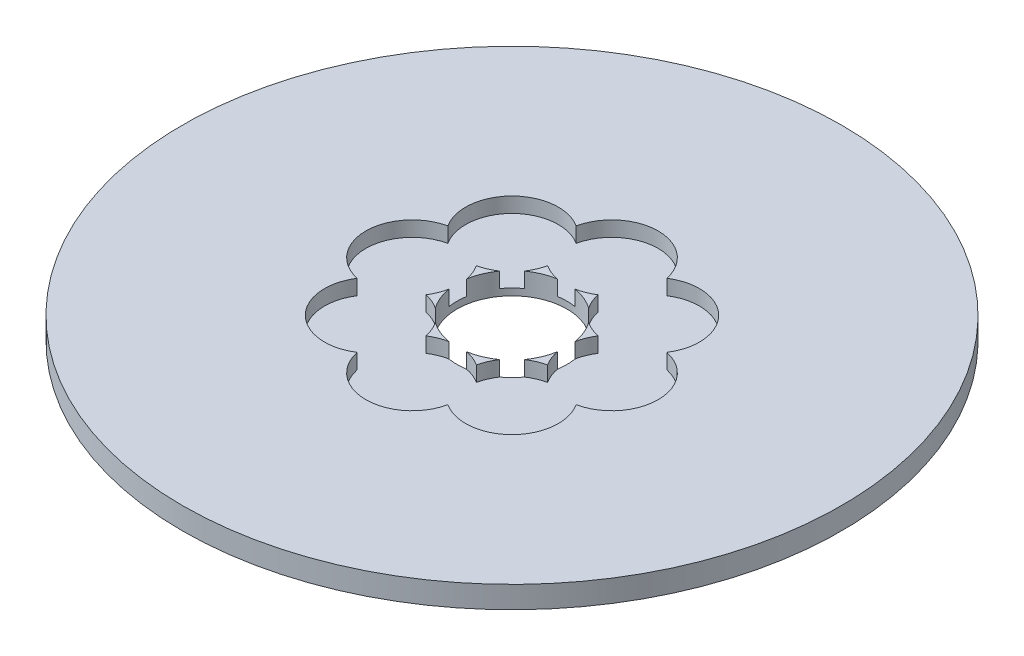
ISO-10303-21;
HEADER;
FILE_DESCRIPTION(('STEP AP214'),'2;1');
FILE_NAME('part.step','',(''),(''),'','','');
FILE_SCHEMA(('AUTOMOTIVE_DESIGN { 1 0 10303 214 1 1 1 1 }'));
ENDSEC;
DATA;
#1=APPLICATION_CONTEXT('core data for automotive mechanical design processes');
#2=APPLICATION_PROTOCOL_DEFINITION('international standard','automotive_design',2000,#1);
#3=PRODUCT_CONTEXT('',#1,'mechanical');
#4=PRODUCT('Part','Part','',(#3));
#5=PRODUCT_RELATED_PRODUCT_CATEGORY('part','',(#4));
#6=PRODUCT_DEFINITION_FORMATION('','',#4);
#7=PRODUCT_DEFINITION_CONTEXT('part definition',#1,'design');
#8=PRODUCT_DEFINITION('design','',#6,#7);
#9=PRODUCT_DEFINITION_SHAPE('','',#8);
#10=(LENGTH_UNIT() NAMED_UNIT(*) SI_UNIT(.MILLI.,.METRE.));
#11=(NAMED_UNIT(*) PLANE_ANGLE_UNIT() SI_UNIT($,.RADIAN.));
#12=(NAMED_UNIT(*) SI_UNIT($,.STERADIAN.) SOLID_ANGLE_UNIT());
#13=UNCERTAINTY_MEASURE_WITH_UNIT(LENGTH_MEASURE(1.E-05),#10,'distance_accuracy_value','');
#14=(GEOMETRIC_REPRESENTATION_CONTEXT(3) GLOBAL_UNCERTAINTY_ASSIGNED_CONTEXT((#13)) GLOBAL_UNIT_ASSIGNED_CONTEXT((#10,
#11,#12)) REPRESENTATION_CONTEXT('',''));
#15=CARTESIAN_POINT('',(0.,0.,0.));
#16=DIRECTION('',(0.,0.,1.));
#17=DIRECTION('',(1.,0.,0.));
#18=AXIS2_PLACEMENT_3D('',#15,#16,#17);
#19=CARTESIAN_POINT('',(0.,4.,0.));
#20=DIRECTION('',(0.,1.,0.));
#21=DIRECTION('',(0.,0.,1.));
#22=AXIS2_PLACEMENT_3D('',#19,#20,#21);
#23=PLANE('',#22);
#24=CARTESIAN_POINT('',(-12.8441599159706,4.,12.8441599159706));
#25=DIRECTION('',(0.,1.,0.));
#26=DIRECTION('',(0.707106781186549,0.,0.707106781186546));
#27=AXIS2_PLACEMENT_3D('',#24,#25,#26);
#28=CIRCLE('',#27,8.44678448829901);
#29=CARTESIAN_POINT('',(-8.11242340434932,4.,5.84710069252834));
#30=VERTEX_POINT('',#29);
#31=CARTESIAN_POINT('',(-11.0707231779052,4.,4.5856436855665));
#32=VERTEX_POINT('',#31);
#33=EDGE_CURVE('E380',#30,#32,#28,.T.);
#34=ORIENTED_EDGE('',*,*,#33,.F.);
#35=CARTESIAN_POINT('',(0.,4.,0.));
#36=DIRECTION('',(0.,1.,0.));
#37=DIRECTION('',(0.,0.,1.));
#38=AXIS2_PLACEMENT_3D('',#35,#36,#37);
#39=CIRCLE('',#38,10.);
#40=CARTESIAN_POINT('',(-9.8708741510392,4.,1.60182505110453));
#41=VERTEX_POINT('',#40);
#42=EDGE_CURVE('E407',#41,#30,#39,.T.);
#43=ORIENTED_EDGE('',*,*,#42,.F.);
#44=CARTESIAN_POINT('',(-18.1643851504545,4.,0.));
#45=DIRECTION('',(0.,1.,0.));
#46=DIRECTION('',(0.,0.,1.));
#47=AXIS2_PLACEMENT_3D('',#44,#45,#46);
#48=CIRCLE('',#47,8.44678448829901);
#49=EDGE_CURVE('E410',#32,#41,#48,.T.);
#50=ORIENTED_EDGE('',*,*,#49,.F.);
#51=EDGE_LOOP('',(#34,#43,#50));
#52=FACE_BOUND('',#51,.T.);
#53=ADVANCED_FACE('F39',(#52),#23,.T.);
#54=CARTESIAN_POINT('',(-12.8441599159708,4.,-12.8441599159705));
#55=DIRECTION('',(0.,1.,0.));
#56=DIRECTION('',(-0.707106781186539,0.,0.707106781186556));
#57=AXIS2_PLACEMENT_3D('',#54,#55,#56);
#58=CIRCLE('',#57,8.44678448829901);
#59=CARTESIAN_POINT('',(-11.0707231779051,4.,-4.58564368556637));
#60=VERTEX_POINT('',#59);
#61=CARTESIAN_POINT('',(-8.11242340434941,4.,-5.84710069252823));
#62=VERTEX_POINT('',#61);
#63=EDGE_CURVE('E285',#60,#62,#58,.T.);
#64=ORIENTED_EDGE('',*,*,#63,.F.);
#65=CARTESIAN_POINT('',(-9.8708741510392,4.,-1.60182505110453));
#66=VERTEX_POINT('',#65);
#67=EDGE_CURVE('E401',#66,#60,#48,.T.);
#68=ORIENTED_EDGE('',*,*,#67,.F.);
#69=EDGE_CURVE('E412',#62,#66,#39,.T.);
#70=ORIENTED_EDGE('',*,*,#69,.F.);
#71=EDGE_LOOP('',(#64,#68,#70));
#72=FACE_BOUND('',#71,.T.);
#73=ADVANCED_FACE('F533',(#72),#23,.T.);
#74=CARTESIAN_POINT('',(-1.90261835353114E-13,4.,-18.1643851504545));
#75=DIRECTION('',(0.,1.,0.));
#76=DIRECTION('',(-1.,0.,0.));
#77=AXIS2_PLACEMENT_3D('',#74,#75,#76);
#78=CIRCLE('',#77,8.44678448829901);
#79=CARTESIAN_POINT('',(1.60182505110443,4.,-9.87087415103922));
#80=VERTEX_POINT('',#79);
#81=CARTESIAN_POINT('',(4.58564368556638,4.,-11.0707231779052));
#82=VERTEX_POINT('',#81);
#83=EDGE_CURVE('E301',#80,#82,#78,.T.);
#84=ORIENTED_EDGE('',*,*,#83,.F.);
#85=CARTESIAN_POINT('',(5.84710069252825,4.,-8.11242340434938));
#86=VERTEX_POINT('',#85);
#87=EDGE_CURVE('E511',#86,#80,#39,.T.);
#88=ORIENTED_EDGE('',*,*,#87,.F.);
#89=CARTESIAN_POINT('',(12.8441599159705,4.,-12.8441599159707));
#90=DIRECTION('',(0.,1.,0.));
#91=DIRECTION('',(-0.707106781186554,0.,-0.707106781186541));
#92=AXIS2_PLACEMENT_3D('',#89,#90,#91);
#93=CIRCLE('',#92,8.44678448829901);
#94=EDGE_CURVE('E313',#82,#86,#93,.T.);
#95=ORIENTED_EDGE('',*,*,#94,.F.);
#96=EDGE_LOOP('',(#84,#88,#95));
#97=FACE_BOUND('',#96,.T.);
#98=ADVANCED_FACE('F574',(#97),#23,.T.);
#99=CARTESIAN_POINT('',(8.11242340434928,4.,-5.84710069252839));
#100=VERTEX_POINT('',#99);
#101=CARTESIAN_POINT('',(11.0707231779052,4.,-4.58564368556656));
#102=VERTEX_POINT('',#101);
#103=EDGE_CURVE('E315',#100,#102,#93,.T.);
#104=ORIENTED_EDGE('',*,*,#103,.F.);
#105=CARTESIAN_POINT('',(9.87087415103921,4.,-1.60182505110454));
#106=VERTEX_POINT('',#105);
#107=EDGE_CURVE('E512',#106,#100,#39,.T.);
#108=ORIENTED_EDGE('',*,*,#107,.F.);
#109=CARTESIAN_POINT('',(18.1643851504545,4.,0.));
#110=DIRECTION('',(0.,1.,0.));
#111=DIRECTION('',(0.,0.,-1.));
#112=AXIS2_PLACEMENT_3D('',#109,#110,#111);
#113=CIRCLE('',#112,8.44678448829901);
#114=EDGE_CURVE('E324',#102,#106,#113,.T.);
#115=ORIENTED_EDGE('',*,*,#114,.F.);
#116=EDGE_LOOP('',(#104,#108,#115));
#117=FACE_BOUND('',#116,.T.);
#118=ADVANCED_FACE('F597',(#117),#23,.T.);
#119=CARTESIAN_POINT('',(9.87087415103921,4.,1.60182505110454));
#120=VERTEX_POINT('',#119);
#121=CARTESIAN_POINT('',(11.0707231779051,4.,4.58564368556644));
#122=VERTEX_POINT('',#121);
#123=EDGE_CURVE('E330',#120,#122,#113,.T.);
#124=ORIENTED_EDGE('',*,*,#123,.F.);
#125=CARTESIAN_POINT('',(8.11242340434937,4.,5.84710069252828));
#126=VERTEX_POINT('',#125);
#127=EDGE_CURVE('E502',#126,#120,#39,.T.);
#128=ORIENTED_EDGE('',*,*,#127,.F.);
#129=CARTESIAN_POINT('',(12.8441599159707,4.,12.8441599159705));
#130=DIRECTION('',(0.,1.,0.));
#131=DIRECTION('',(0.707106781186544,0.,-0.707106781186551));
#132=AXIS2_PLACEMENT_3D('',#129,#130,#131);
#133=CIRCLE('',#132,8.44678448829901);
#134=EDGE_CURVE('E336',#122,#126,#133,.T.);
#135=ORIENTED_EDGE('',*,*,#134,.F.);
#136=EDGE_LOOP('',(#124,#128,#135));
#137=FACE_BOUND('',#136,.T.);
#138=ADVANCED_FACE('F505',(#137),#23,.T.);
#139=CARTESIAN_POINT('',(5.84710069252837,4.,8.1124234043493));
#140=VERTEX_POINT('',#139);
#141=CARTESIAN_POINT('',(4.58564368556654,4.,11.0707231779051));
#142=VERTEX_POINT('',#141);
#143=EDGE_CURVE('E325',#140,#142,#133,.T.);
#144=ORIENTED_EDGE('',*,*,#143,.F.);
#145=CARTESIAN_POINT('',(1.60182505110457,4.,9.8708741510392));
#146=VERTEX_POINT('',#145);
#147=EDGE_CURVE('E509',#146,#140,#39,.T.);
#148=ORIENTED_EDGE('',*,*,#147,.F.);
#149=CARTESIAN_POINT('',(0.,4.,18.1643851504545));
#150=DIRECTION('',(0.,1.,0.));
#151=DIRECTION('',(1.,0.,0.));
#152=AXIS2_PLACEMENT_3D('',#149,#150,#151);
#153=CIRCLE('',#152,8.44678448829901);
#154=EDGE_CURVE('E349',#142,#146,#153,.T.);
#155=ORIENTED_EDGE('',*,*,#154,.F.);
#156=EDGE_LOOP('',(#144,#148,#155));
#157=FACE_BOUND('',#156,.T.);
#158=ADVANCED_FACE('F508',(#157),#23,.T.);
#159=CARTESIAN_POINT('',(-1.6018250511045,4.,9.87087415103921));
#160=VERTEX_POINT('',#159);
#161=CARTESIAN_POINT('',(-4.58564368556646,4.,11.0707231779052));
#162=VERTEX_POINT('',#161);
#163=EDGE_CURVE('E351',#160,#162,#153,.T.);
#164=ORIENTED_EDGE('',*,*,#163,.F.);
#165=CARTESIAN_POINT('',(-5.84710069252831,4.,8.11242340434934));
#166=VERTEX_POINT('',#165);
#167=EDGE_CURVE('E415',#166,#160,#39,.T.);
#168=ORIENTED_EDGE('',*,*,#167,.F.);
#169=EDGE_CURVE('E374',#162,#166,#28,.T.);
#170=ORIENTED_EDGE('',*,*,#169,.F.);
#171=EDGE_LOOP('',(#164,#168,#170));
#172=FACE_BOUND('',#171,.T.);
#173=ADVANCED_FACE('F467',(#172),#23,.T.);
#174=CARTESIAN_POINT('',(-4.58564368556661,4.,-11.0707231779051));
#175=VERTEX_POINT('',#174);
#176=CARTESIAN_POINT('',(-1.60182505110464,4.,-9.87087415103919));
#177=VERTEX_POINT('',#176);
#178=EDGE_CURVE('E257',#175,#177,#78,.T.);
#179=ORIENTED_EDGE('',*,*,#178,.F.);
#180=CARTESIAN_POINT('',(-5.84710069252842,4.,-8.11242340434926));
#181=VERTEX_POINT('',#180);
#182=EDGE_CURVE('E282',#181,#175,#58,.T.);
#183=ORIENTED_EDGE('',*,*,#182,.F.);
#184=EDGE_CURVE('E299',#177,#181,#39,.T.);
#185=ORIENTED_EDGE('',*,*,#184,.F.);
#186=EDGE_LOOP('',(#179,#183,#185));
#187=FACE_BOUND('',#186,.T.);
#188=ADVANCED_FACE('F298',(#187),#23,.T.);
#189=CARTESIAN_POINT('',(-18.1643851504545,1.24408715647174,0.));
#190=DIRECTION('',(0.,1.,0.));
#191=DIRECTION('',(0.,0.,1.));
#192=AXIS2_PLACEMENT_3D('',#189,#190,#191);
#193=CYLINDRICAL_SURFACE('',#192,8.44678448829901);
#194=CARTESIAN_POINT('',(-18.1643851504545,1.24408715647174,0.));
#195=DIRECTION('',(0.,1.,0.));
#196=DIRECTION('',(0.,0.,1.));
#197=AXIS2_PLACEMENT_3D('',#194,#195,#196);
#198=CIRCLE('',#197,8.44678448829901);
#199=CARTESIAN_POINT('',(-11.0707231779052,1.24408715647174,4.5856436855665));
#200=VERTEX_POINT('',#199);
#201=CARTESIAN_POINT('',(-9.8708741510392,1.24408715647174,1.60182505110453));
#202=VERTEX_POINT('',#201);
#203=EDGE_CURVE('E65',#200,#202,#198,.T.);
#204=ORIENTED_EDGE('',*,*,#203,.F.);
#205=DIRECTION('',(0.,1.,0.));
#206=VECTOR('',#205,1.);
#207=CARTESIAN_POINT('',(-11.0707231779052,2.62204357823587,4.5856436855665));
#208=LINE('',#207,#206);
#209=EDGE_CURVE('E387',#200,#32,#208,.T.);
#210=ORIENTED_EDGE('',*,*,#209,.T.);
#211=ORIENTED_EDGE('',*,*,#49,.T.);
#212=DIRECTION('',(0.,1.,0.));
#213=VECTOR('',#212,1.);
#214=CARTESIAN_POINT('',(-9.87087415103921,2.62204357823587,1.60182505110454));
#215=LINE('',#214,#213);
#216=EDGE_CURVE('E424',#41,#202,#215,.F.);
#217=ORIENTED_EDGE('',*,*,#216,.T.);
#218=EDGE_LOOP('',(#204,#210,#211,#217));
#219=FACE_BOUND('',#218,.T.);
#220=ADVANCED_FACE('F590',(#219),#193,.F.);
#221=CARTESIAN_POINT('',(-19.9378218885202,4.,-8.25851623040409));
#222=VERTEX_POINT('',#221);
#223=CARTESIAN_POINT('',(-19.9378218885199,4.,8.25851623040414));
#224=VERTEX_POINT('',#223);
#225=EDGE_CURVE('E406',#222,#224,#48,.T.);
#226=ORIENTED_EDGE('',*,*,#225,.T.);
#227=DIRECTION('',(0.,1.,0.));
#228=VECTOR('',#227,1.);
#229=CARTESIAN_POINT('',(-19.9378218885199,2.62204357823587,8.25851623040414));
#230=LINE('',#229,#228);
#231=CARTESIAN_POINT('',(-19.9378218885199,1.24408715647174,8.25851623040414));
#232=VERTEX_POINT('',#231);
#233=EDGE_CURVE('E382',#224,#232,#230,.F.);
#234=ORIENTED_EDGE('',*,*,#233,.T.);
#235=CARTESIAN_POINT('',(-19.9378218885202,1.24408715647174,-8.25851623040409));
#236=VERTEX_POINT('',#235);
#237=EDGE_CURVE('E405',#236,#232,#198,.T.);
#238=ORIENTED_EDGE('',*,*,#237,.F.);
#239=DIRECTION('',(0.,1.,0.));
#240=VECTOR('',#239,1.);
#241=CARTESIAN_POINT('',(-19.9378218885202,2.62204357823587,-8.25851623040409));
#242=LINE('',#241,#240);
#243=EDGE_CURVE('E273',#236,#222,#242,.T.);
#244=ORIENTED_EDGE('',*,*,#243,.T.);
#245=EDGE_LOOP('',(#226,#234,#238,#244));
#246=FACE_BOUND('',#245,.T.);
#247=ADVANCED_FACE('F544',(#246),#193,.F.);
#248=CARTESIAN_POINT('',(0.,4.,0.));
#249=DIRECTION('',(0.,-1.,0.));
#250=DIRECTION('',(0.,0.,-1.));
#251=AXIS2_PLACEMENT_3D('',#248,#249,#250);
#252=CYLINDRICAL_SURFACE('',#251,60.);
#253=CARTESIAN_POINT('',(0.,4.,0.));
#254=DIRECTION('',(0.,1.,0.));
#255=DIRECTION('',(0.,0.,1.));
#256=AXIS2_PLACEMENT_3D('',#253,#254,#255);
#257=CIRCLE('',#256,60.);
#258=CARTESIAN_POINT('',(0.,4.,60.));
#259=VERTEX_POINT('',#258);
#260=EDGE_CURVE('E418',#259,#259,#257,.T.);
#261=ORIENTED_EDGE('',*,*,#260,.F.);
#262=EDGE_LOOP('',(#261));
#263=FACE_BOUND('',#262,.T.);
#264=CARTESIAN_POINT('',(0.,0.,0.));
#265=DIRECTION('',(0.,1.,0.));
#266=DIRECTION('',(0.,0.,1.));
#267=AXIS2_PLACEMENT_3D('',#264,#265,#266);
#268=CIRCLE('',#267,60.);
#269=CARTESIAN_POINT('',(0.,0.,60.));
#270=VERTEX_POINT('',#269);
#271=EDGE_CURVE('E411',#270,#270,#268,.T.);
#272=ORIENTED_EDGE('',*,*,#271,.T.);
#273=EDGE_LOOP('',(#272));
#274=FACE_BOUND('',#273,.T.);
#275=ADVANCED_FACE('F41',(#263,#274),#252,.T.);
#276=CARTESIAN_POINT('',(-8.25851623040407,4.,19.93782188852));
#277=VERTEX_POINT('',#276);
#278=EDGE_CURVE('E366',#224,#277,#28,.T.);
#279=ORIENTED_EDGE('',*,*,#278,.F.);
#280=ORIENTED_EDGE('',*,*,#225,.F.);
#281=CARTESIAN_POINT('',(-8.25851623040435,4.,-19.9378218885199));
#282=VERTEX_POINT('',#281);
#283=EDGE_CURVE('E279',#282,#222,#58,.T.);
#284=ORIENTED_EDGE('',*,*,#283,.F.);
#285=CARTESIAN_POINT('',(8.25851623040393,4.,-19.93782188852));
#286=VERTEX_POINT('',#285);
#287=EDGE_CURVE('E270',#286,#282,#78,.T.);
#288=ORIENTED_EDGE('',*,*,#287,.F.);
#289=CARTESIAN_POINT('',(19.9378218885198,4.,-8.25851623040417));
#290=VERTEX_POINT('',#289);
#291=EDGE_CURVE('E306',#290,#286,#93,.T.);
#292=ORIENTED_EDGE('',*,*,#291,.F.);
#293=CARTESIAN_POINT('',(19.9378218885201,4.,8.25851623040411));
#294=VERTEX_POINT('',#293);
#295=EDGE_CURVE('E318',#294,#290,#113,.T.);
#296=ORIENTED_EDGE('',*,*,#295,.F.);
#297=CARTESIAN_POINT('',(8.25851623040421,4.,19.9378218885199));
#298=VERTEX_POINT('',#297);
#299=EDGE_CURVE('E334',#298,#294,#133,.T.);
#300=ORIENTED_EDGE('',*,*,#299,.F.);
#301=EDGE_CURVE('E345',#277,#298,#153,.T.);
#302=ORIENTED_EDGE('',*,*,#301,.F.);
#303=EDGE_LOOP('',(#279,#280,#284,#288,#292,#296,#300,#302));
#304=FACE_BOUND('',#303,.T.);
#305=ORIENTED_EDGE('',*,*,#260,.T.);
#306=EDGE_LOOP('',(#305));
#307=FACE_BOUND('',#306,.T.);
#308=ADVANCED_FACE('F485',(#304,#307),#23,.T.);
#309=CARTESIAN_POINT('',(0.,0.,0.));
#310=DIRECTION('',(0.,1.,0.));
#311=DIRECTION('',(0.,0.,1.));
#312=AXIS2_PLACEMENT_3D('',#309,#310,#311);
#313=PLANE('',#312);
#314=CARTESIAN_POINT('',(0.,0.,0.));
#315=DIRECTION('',(0.,1.,0.));
#316=DIRECTION('',(0.,0.,1.));
#317=AXIS2_PLACEMENT_3D('',#314,#315,#316);
#318=CIRCLE('',#317,10.);
#319=CARTESIAN_POINT('',(0.,0.,10.));
#320=VERTEX_POINT('',#319);
#321=EDGE_CURVE('E402',#320,#320,#318,.T.);
#322=ORIENTED_EDGE('',*,*,#321,.T.);
#323=EDGE_LOOP('',(#322));
#324=FACE_BOUND('',#323,.T.);
#325=ORIENTED_EDGE('',*,*,#271,.F.);
#326=EDGE_LOOP('',(#325));
#327=FACE_BOUND('',#326,.T.);
#328=ADVANCED_FACE('F577',(#324,#327),#313,.F.);
#329=CARTESIAN_POINT('',(0.,4.,0.));
#330=DIRECTION('',(0.,-1.,0.));
#331=DIRECTION('',(0.,0.,-1.));
#332=AXIS2_PLACEMENT_3D('',#329,#330,#331);
#333=CYLINDRICAL_SURFACE('',#332,10.);
#334=DIRECTION('',(0.,1.,0.));
#335=VECTOR('',#334,1.);
#336=CARTESIAN_POINT('',(-8.11242340434933,2.62204357823587,5.84710069252834));
#337=LINE('',#336,#335);
#338=CARTESIAN_POINT('',(-8.11242340434932,1.24408715647174,5.84710069252834));
#339=VERTEX_POINT('',#338);
#340=EDGE_CURVE('E391',#339,#30,#337,.T.);
#341=ORIENTED_EDGE('',*,*,#340,.F.);
#342=CARTESIAN_POINT('',(0.,1.24408715647174,0.));
#343=DIRECTION('',(0.,1.,0.));
#344=DIRECTION('',(0.,0.,1.));
#345=AXIS2_PLACEMENT_3D('',#342,#343,#344);
#346=CIRCLE('',#345,10.);
#347=CARTESIAN_POINT('',(-5.84710069252831,1.24408715647174,8.11242340434934));
#348=VERTEX_POINT('',#347);
#349=EDGE_CURVE('E396',#339,#348,#346,.T.);
#350=ORIENTED_EDGE('',*,*,#349,.T.);
#351=DIRECTION('',(0.,1.,0.));
#352=VECTOR('',#351,1.);
#353=CARTESIAN_POINT('',(-5.84710069252831,2.62204357823587,8.11242340434934));
#354=LINE('',#353,#352);
#355=EDGE_CURVE('E386',#166,#348,#354,.F.);
#356=ORIENTED_EDGE('',*,*,#355,.F.);
#357=ORIENTED_EDGE('',*,*,#167,.T.);
#358=DIRECTION('',(0.,1.,0.));
#359=VECTOR('',#358,1.);
#360=CARTESIAN_POINT('',(-1.6018250511045,2.62204357823587,9.87087415103921));
#361=LINE('',#360,#359);
#362=CARTESIAN_POINT('',(-1.6018250511045,1.24408715647174,9.87087415103921));
#363=VERTEX_POINT('',#362);
#364=EDGE_CURVE('E11',#363,#160,#361,.T.);
#365=ORIENTED_EDGE('',*,*,#364,.F.);
#366=CARTESIAN_POINT('',(1.60182505110457,1.24408715647174,9.8708741510392));
#367=VERTEX_POINT('',#366);
#368=EDGE_CURVE('E392',#363,#367,#346,.T.);
#369=ORIENTED_EDGE('',*,*,#368,.T.);
#370=DIRECTION('',(0.,1.,0.));
#371=VECTOR('',#370,1.);
#372=CARTESIAN_POINT('',(1.60182505110457,2.62204357823587,9.8708741510392));
#373=LINE('',#372,#371);
#374=EDGE_CURVE('E50',#146,#367,#373,.F.);
#375=ORIENTED_EDGE('',*,*,#374,.F.);
#376=ORIENTED_EDGE('',*,*,#147,.T.);
#377=DIRECTION('',(0.,1.,0.));
#378=VECTOR('',#377,1.);
#379=CARTESIAN_POINT('',(5.84710069252837,2.62204357823587,8.1124234043493));
#380=LINE('',#379,#378);
#381=CARTESIAN_POINT('',(5.84710069252837,1.24408715647174,8.1124234043493));
#382=VERTEX_POINT('',#381);
#383=EDGE_CURVE('E438',#382,#140,#380,.T.);
#384=ORIENTED_EDGE('',*,*,#383,.F.);
#385=CARTESIAN_POINT('',(8.11242340434937,1.24408715647174,5.84710069252828));
#386=VERTEX_POINT('',#385);
#387=EDGE_CURVE('E400',#382,#386,#346,.T.);
#388=ORIENTED_EDGE('',*,*,#387,.T.);
#389=DIRECTION('',(0.,1.,0.));
#390=VECTOR('',#389,1.);
#391=CARTESIAN_POINT('',(8.11242340434937,2.62204357823587,5.84710069252828));
#392=LINE('',#391,#390);
#393=EDGE_CURVE('E440',#126,#386,#392,.F.);
#394=ORIENTED_EDGE('',*,*,#393,.F.);
#395=ORIENTED_EDGE('',*,*,#127,.T.);
#396=DIRECTION('',(0.,1.,0.));
#397=VECTOR('',#396,1.);
#398=CARTESIAN_POINT('',(9.87087415103921,2.62204357823587,1.60182505110454));
#399=LINE('',#398,#397);
#400=CARTESIAN_POINT('',(9.87087415103921,1.24408715647174,1.60182505110454));
#401=VERTEX_POINT('',#400);
#402=EDGE_CURVE('E434',#401,#120,#399,.T.);
#403=ORIENTED_EDGE('',*,*,#402,.F.);
#404=CARTESIAN_POINT('',(9.87087415103921,1.24408715647174,-1.60182505110454));
#405=VERTEX_POINT('',#404);
#406=EDGE_CURVE('E550',#401,#405,#346,.T.);
#407=ORIENTED_EDGE('',*,*,#406,.T.);
#408=DIRECTION('',(0.,1.,0.));
#409=VECTOR('',#408,1.);
#410=CARTESIAN_POINT('',(9.87087415103921,2.62204357823587,-1.60182505110454));
#411=LINE('',#410,#409);
#412=EDGE_CURVE('E433',#106,#405,#411,.F.);
#413=ORIENTED_EDGE('',*,*,#412,.F.);
#414=ORIENTED_EDGE('',*,*,#107,.T.);
#415=DIRECTION('',(0.,1.,0.));
#416=VECTOR('',#415,1.);
#417=CARTESIAN_POINT('',(8.11242340434928,2.62204357823587,-5.84710069252839));
#418=LINE('',#417,#416);
#419=CARTESIAN_POINT('',(8.11242340434928,1.24408715647174,-5.84710069252839));
#420=VERTEX_POINT('',#419);
#421=EDGE_CURVE('E444',#420,#100,#418,.T.);
#422=ORIENTED_EDGE('',*,*,#421,.F.);
#423=CARTESIAN_POINT('',(5.84710069252825,1.24408715647174,-8.11242340434938));
#424=VERTEX_POINT('',#423);
#425=EDGE_CURVE('E548',#420,#424,#346,.T.);
#426=ORIENTED_EDGE('',*,*,#425,.T.);
#427=DIRECTION('',(0.,1.,0.));
#428=VECTOR('',#427,1.);
#429=CARTESIAN_POINT('',(5.84710069252825,2.62204357823587,-8.11242340434938));
#430=LINE('',#429,#428);
#431=EDGE_CURVE('E442',#86,#424,#430,.F.);
#432=ORIENTED_EDGE('',*,*,#431,.F.);
#433=ORIENTED_EDGE('',*,*,#87,.T.);
#434=DIRECTION('',(0.,1.,0.));
#435=VECTOR('',#434,1.);
#436=CARTESIAN_POINT('',(1.60182505110443,2.62204357823587,-9.87087415103922));
#437=LINE('',#436,#435);
#438=CARTESIAN_POINT('',(1.60182505110443,1.24408715647174,-9.87087415103922));
#439=VERTEX_POINT('',#438);
#440=EDGE_CURVE('E431',#439,#80,#437,.T.);
#441=ORIENTED_EDGE('',*,*,#440,.F.);
#442=CARTESIAN_POINT('',(-1.60182505110464,1.24408715647174,-9.87087415103919));
#443=VERTEX_POINT('',#442);
#444=EDGE_CURVE('E552',#439,#443,#346,.T.);
#445=ORIENTED_EDGE('',*,*,#444,.T.);
#446=DIRECTION('',(0.,1.,0.));
#447=VECTOR('',#446,1.);
#448=CARTESIAN_POINT('',(-1.60182505110464,2.62204357823587,-9.87087415103919));
#449=LINE('',#448,#447);
#450=EDGE_CURVE('E427',#177,#443,#449,.F.);
#451=ORIENTED_EDGE('',*,*,#450,.F.);
#452=ORIENTED_EDGE('',*,*,#184,.T.);
#453=DIRECTION('',(0.,1.,0.));
#454=VECTOR('',#453,1.);
#455=CARTESIAN_POINT('',(-5.84710069252842,2.62204357823587,-8.11242340434926));
#456=LINE('',#455,#454);
#457=CARTESIAN_POINT('',(-5.84710069252842,1.24408715647174,-8.11242340434926));
#458=VERTEX_POINT('',#457);
#459=EDGE_CURVE('E289',#458,#181,#456,.T.);
#460=ORIENTED_EDGE('',*,*,#459,.F.);
#461=CARTESIAN_POINT('',(-8.11242340434941,1.24408715647174,-5.84710069252823));
#462=VERTEX_POINT('',#461);
#463=EDGE_CURVE('E554',#458,#462,#346,.T.);
#464=ORIENTED_EDGE('',*,*,#463,.T.);
#465=DIRECTION('',(0.,1.,0.));
#466=VECTOR('',#465,1.);
#467=CARTESIAN_POINT('',(-8.11242340434941,2.62204357823587,-5.84710069252823));
#468=LINE('',#467,#466);
#469=EDGE_CURVE('E379',#62,#462,#468,.F.);
#470=ORIENTED_EDGE('',*,*,#469,.F.);
#471=ORIENTED_EDGE('',*,*,#69,.T.);
#472=DIRECTION('',(0.,1.,0.));
#473=VECTOR('',#472,1.);
#474=CARTESIAN_POINT('',(-9.87087415103921,2.62204357823587,-1.60182505110454));
#475=LINE('',#474,#473);
#476=CARTESIAN_POINT('',(-9.8708741510392,1.24408715647174,-1.60182505110453));
#477=VERTEX_POINT('',#476);
#478=EDGE_CURVE('E426',#477,#66,#475,.T.);
#479=ORIENTED_EDGE('',*,*,#478,.F.);
#480=CARTESIAN_POINT('',(0.,1.24408715647174,0.));
#481=DIRECTION('',(0.,1.,0.));
#482=DIRECTION('',(0.,0.,1.));
#483=AXIS2_PLACEMENT_3D('',#480,#481,#482);
#484=CIRCLE('',#483,10.);
#485=EDGE_CURVE('E420',#477,#202,#484,.T.);
#486=ORIENTED_EDGE('',*,*,#485,.T.);
#487=ORIENTED_EDGE('',*,*,#216,.F.);
#488=ORIENTED_EDGE('',*,*,#42,.T.);
#489=EDGE_LOOP('',(#341,#350,#356,#357,#365,#369,#375,#376,#384,#388,#394,#395,#403,#407,#413,
#414,#422,#426,#432,#433,#441,#445,#451,#452,#460,#464,#470,#471,#479,#486,#487,#488));
#490=FACE_BOUND('',#489,.T.);
#491=ORIENTED_EDGE('',*,*,#321,.F.);
#492=EDGE_LOOP('',(#491));
#493=FACE_BOUND('',#492,.T.);
#494=ADVANCED_FACE('F460',(#490,#493),#333,.F.);
#495=ORIENTED_EDGE('',*,*,#67,.T.);
#496=DIRECTION('',(0.,1.,0.));
#497=VECTOR('',#496,1.);
#498=CARTESIAN_POINT('',(-11.0707231779051,2.62204357823587,-4.58564368556637));
#499=LINE('',#498,#497);
#500=CARTESIAN_POINT('',(-11.0707231779051,1.24408715647174,-4.58564368556637));
#501=VERTEX_POINT('',#500);
#502=EDGE_CURVE('E375',#60,#501,#499,.F.);
#503=ORIENTED_EDGE('',*,*,#502,.T.);
#504=EDGE_CURVE('E397',#477,#501,#198,.T.);
#505=ORIENTED_EDGE('',*,*,#504,.F.);
#506=ORIENTED_EDGE('',*,*,#478,.T.);
#507=EDGE_LOOP('',(#495,#503,#505,#506));
#508=FACE_BOUND('',#507,.T.);
#509=ADVANCED_FACE('F529',(#508),#193,.F.);
#510=CARTESIAN_POINT('',(-18.1643851504545,1.24408715647174,0.));
#511=DIRECTION('',(0.,1.,0.));
#512=DIRECTION('',(0.,0.,1.));
#513=AXIS2_PLACEMENT_3D('',#510,#511,#512);
#514=PLANE('',#513);
#515=CARTESIAN_POINT('',(-12.8441599159708,1.24408715647174,-12.8441599159705));
#516=DIRECTION('',(0.,1.,0.));
#517=DIRECTION('',(-0.707106781186539,0.,0.707106781186556));
#518=AXIS2_PLACEMENT_3D('',#515,#516,#517);
#519=CIRCLE('',#518,8.44678448829901);
#520=CARTESIAN_POINT('',(-8.25851623040435,1.24408715647174,-19.9378218885199));
#521=VERTEX_POINT('',#520);
#522=EDGE_CURVE('E251',#521,#236,#519,.T.);
#523=ORIENTED_EDGE('',*,*,#522,.T.);
#524=ORIENTED_EDGE('',*,*,#237,.T.);
#525=CARTESIAN_POINT('',(-12.8441599159706,1.24408715647174,12.8441599159706));
#526=DIRECTION('',(0.,1.,0.));
#527=DIRECTION('',(0.707106781186549,0.,0.707106781186546));
#528=AXIS2_PLACEMENT_3D('',#525,#526,#527);
#529=CIRCLE('',#528,8.44678448829901);
#530=CARTESIAN_POINT('',(-8.25851623040407,1.24408715647174,19.93782188852));
#531=VERTEX_POINT('',#530);
#532=EDGE_CURVE('E372',#232,#531,#529,.T.);
#533=ORIENTED_EDGE('',*,*,#532,.T.);
#534=CARTESIAN_POINT('',(0.,1.24408715647174,18.1643851504545));
#535=DIRECTION('',(0.,1.,0.));
#536=DIRECTION('',(1.,0.,0.));
#537=AXIS2_PLACEMENT_3D('',#534,#535,#536);
#538=CIRCLE('',#537,8.44678448829901);
#539=CARTESIAN_POINT('',(8.25851623040421,1.24408715647174,19.9378218885199));
#540=VERTEX_POINT('',#539);
#541=EDGE_CURVE('E346',#531,#540,#538,.T.);
#542=ORIENTED_EDGE('',*,*,#541,.T.);
#543=CARTESIAN_POINT('',(12.8441599159707,1.24408715647174,12.8441599159705));
#544=DIRECTION('',(0.,1.,0.));
#545=DIRECTION('',(0.707106781186544,0.,-0.707106781186551));
#546=AXIS2_PLACEMENT_3D('',#543,#544,#545);
#547=CIRCLE('',#546,8.44678448829901);
#548=CARTESIAN_POINT('',(19.9378218885201,1.24408715647174,8.25851623040411));
#549=VERTEX_POINT('',#548);
#550=EDGE_CURVE('E327',#540,#549,#547,.T.);
#551=ORIENTED_EDGE('',*,*,#550,.T.);
#552=CARTESIAN_POINT('',(18.1643851504545,1.24408715647174,0.));
#553=DIRECTION('',(0.,1.,0.));
#554=DIRECTION('',(0.,0.,-1.));
#555=AXIS2_PLACEMENT_3D('',#552,#553,#554);
#556=CIRCLE('',#555,8.44678448829901);
#557=CARTESIAN_POINT('',(19.9378218885198,1.24408715647174,-8.25851623040417));
#558=VERTEX_POINT('',#557);
#559=EDGE_CURVE('E322',#549,#558,#556,.T.);
#560=ORIENTED_EDGE('',*,*,#559,.T.);
#561=CARTESIAN_POINT('',(12.8441599159705,1.24408715647174,-12.8441599159707));
#562=DIRECTION('',(0.,1.,0.));
#563=DIRECTION('',(-0.707106781186554,0.,-0.707106781186541));
#564=AXIS2_PLACEMENT_3D('',#561,#562,#563);
#565=CIRCLE('',#564,8.44678448829901);
#566=CARTESIAN_POINT('',(8.25851623040393,1.24408715647174,-19.93782188852));
#567=VERTEX_POINT('',#566);
#568=EDGE_CURVE('E258',#558,#567,#565,.T.);
#569=ORIENTED_EDGE('',*,*,#568,.T.);
#570=CARTESIAN_POINT('',(-1.90261835353114E-13,1.24408715647174,-18.1643851504545));
#571=DIRECTION('',(0.,1.,0.));
#572=DIRECTION('',(-1.,0.,0.));
#573=AXIS2_PLACEMENT_3D('',#570,#571,#572);
#574=CIRCLE('',#573,8.44678448829901);
#575=EDGE_CURVE('E247',#567,#521,#574,.T.);
#576=ORIENTED_EDGE('',*,*,#575,.T.);
#577=EDGE_LOOP('',(#523,#524,#533,#542,#551,#560,#569,#576));
#578=FACE_BOUND('',#577,.T.);
#579=ORIENTED_EDGE('',*,*,#504,.T.);
#580=EDGE_CURVE('E53',#501,#462,#519,.T.);
#581=ORIENTED_EDGE('',*,*,#580,.T.);
#582=ORIENTED_EDGE('',*,*,#463,.F.);
#583=CARTESIAN_POINT('',(-4.58564368556661,1.24408715647174,-11.0707231779051));
#584=VERTEX_POINT('',#583);
#585=EDGE_CURVE('E277',#458,#584,#519,.T.);
#586=ORIENTED_EDGE('',*,*,#585,.T.);
#587=EDGE_CURVE('E265',#584,#443,#574,.T.);
#588=ORIENTED_EDGE('',*,*,#587,.T.);
#589=ORIENTED_EDGE('',*,*,#444,.F.);
#590=CARTESIAN_POINT('',(4.58564368556638,1.24408715647174,-11.0707231779052));
#591=VERTEX_POINT('',#590);
#592=EDGE_CURVE('E259',#439,#591,#574,.T.);
#593=ORIENTED_EDGE('',*,*,#592,.T.);
#594=EDGE_CURVE('E308',#591,#424,#565,.T.);
#595=ORIENTED_EDGE('',*,*,#594,.T.);
#596=ORIENTED_EDGE('',*,*,#425,.F.);
#597=CARTESIAN_POINT('',(11.0707231779052,1.24408715647174,-4.58564368556656));
#598=VERTEX_POINT('',#597);
#599=EDGE_CURVE('E307',#420,#598,#565,.T.);
#600=ORIENTED_EDGE('',*,*,#599,.T.);
#601=EDGE_CURVE('E317',#598,#405,#556,.T.);
#602=ORIENTED_EDGE('',*,*,#601,.T.);
#603=ORIENTED_EDGE('',*,*,#406,.F.);
#604=CARTESIAN_POINT('',(11.0707231779051,1.24408715647174,4.58564368556644));
#605=VERTEX_POINT('',#604);
#606=EDGE_CURVE('E323',#401,#605,#556,.T.);
#607=ORIENTED_EDGE('',*,*,#606,.T.);
#608=EDGE_CURVE('E332',#605,#386,#547,.T.);
#609=ORIENTED_EDGE('',*,*,#608,.T.);
#610=ORIENTED_EDGE('',*,*,#387,.F.);
#611=CARTESIAN_POINT('',(4.58564368556654,1.24408715647174,11.0707231779051));
#612=VERTEX_POINT('',#611);
#613=EDGE_CURVE('E335',#382,#612,#547,.T.);
#614=ORIENTED_EDGE('',*,*,#613,.T.);
#615=EDGE_CURVE('E342',#612,#367,#538,.T.);
#616=ORIENTED_EDGE('',*,*,#615,.T.);
#617=ORIENTED_EDGE('',*,*,#368,.F.);
#618=CARTESIAN_POINT('',(-4.58564368556646,1.24408715647174,11.0707231779052));
#619=VERTEX_POINT('',#618);
#620=EDGE_CURVE('E350',#363,#619,#538,.T.);
#621=ORIENTED_EDGE('',*,*,#620,.T.);
#622=EDGE_CURVE('E369',#619,#348,#529,.T.);
#623=ORIENTED_EDGE('',*,*,#622,.T.);
#624=ORIENTED_EDGE('',*,*,#349,.F.);
#625=EDGE_CURVE('E373',#339,#200,#529,.T.);
#626=ORIENTED_EDGE('',*,*,#625,.T.);
#627=ORIENTED_EDGE('',*,*,#203,.T.);
#628=ORIENTED_EDGE('',*,*,#485,.F.);
#629=EDGE_LOOP('',(#579,#581,#582,#586,#588,#589,#593,#595,#596,#600,#602,#603,#607,#609,#610,
#614,#616,#617,#621,#623,#624,#626,#627,#628));
#630=FACE_BOUND('',#629,.T.);
#631=ADVANCED_FACE('F249',(#578,#630),#514,.T.);
#632=CARTESIAN_POINT('',(0.,1.24408715647174,18.1643851504545));
#633=DIRECTION('',(0.,1.,0.));
#634=DIRECTION('',(0.,0.,1.));
#635=AXIS2_PLACEMENT_3D('',#632,#633,#634);
#636=CYLINDRICAL_SURFACE('',#635,8.44678448829901);
#637=ORIENTED_EDGE('',*,*,#364,.T.);
#638=ORIENTED_EDGE('',*,*,#163,.T.);
#639=DIRECTION('',(0.,1.,0.));
#640=VECTOR('',#639,1.);
#641=CARTESIAN_POINT('',(-4.58564368556646,2.62204357823587,11.0707231779052));
#642=LINE('',#641,#640);
#643=EDGE_CURVE('E364',#619,#162,#642,.T.);
#644=ORIENTED_EDGE('',*,*,#643,.F.);
#645=ORIENTED_EDGE('',*,*,#620,.F.);
#646=EDGE_LOOP('',(#637,#638,#644,#645));
#647=FACE_BOUND('',#646,.T.);
#648=ADVANCED_FACE('F463',(#647),#636,.F.);
#649=CARTESIAN_POINT('',(12.8441599159705,1.24408715647174,-12.8441599159707));
#650=DIRECTION('',(0.,1.,0.));
#651=DIRECTION('',(0.,0.,1.));
#652=AXIS2_PLACEMENT_3D('',#649,#650,#651);
#653=CYLINDRICAL_SURFACE('',#652,8.44678448829901);
#654=ORIENTED_EDGE('',*,*,#421,.T.);
#655=ORIENTED_EDGE('',*,*,#103,.T.);
#656=DIRECTION('',(0.,1.,0.));
#657=VECTOR('',#656,1.);
#658=CARTESIAN_POINT('',(11.0707231779052,2.62204357823587,-4.58564368556656));
#659=LINE('',#658,#657);
#660=EDGE_CURVE('E312',#598,#102,#659,.T.);
#661=ORIENTED_EDGE('',*,*,#660,.F.);
#662=ORIENTED_EDGE('',*,*,#599,.F.);
#663=EDGE_LOOP('',(#654,#655,#661,#662));
#664=FACE_BOUND('',#663,.T.);
#665=ADVANCED_FACE('F621',(#664),#653,.F.);
#666=CARTESIAN_POINT('',(12.8441599159707,1.24408715647174,12.8441599159705));
#667=DIRECTION('',(0.,1.,0.));
#668=DIRECTION('',(0.,0.,1.));
#669=AXIS2_PLACEMENT_3D('',#666,#667,#668);
#670=CYLINDRICAL_SURFACE('',#669,8.44678448829901);
#671=ORIENTED_EDGE('',*,*,#383,.T.);
#672=ORIENTED_EDGE('',*,*,#143,.T.);
#673=DIRECTION('',(0.,1.,0.));
#674=VECTOR('',#673,1.);
#675=CARTESIAN_POINT('',(4.58564368556654,2.62204357823587,11.0707231779051));
#676=LINE('',#675,#674);
#677=EDGE_CURVE('E338',#612,#142,#676,.T.);
#678=ORIENTED_EDGE('',*,*,#677,.F.);
#679=ORIENTED_EDGE('',*,*,#613,.F.);
#680=EDGE_LOOP('',(#671,#672,#678,#679));
#681=FACE_BOUND('',#680,.T.);
#682=ADVANCED_FACE('F506',(#681),#670,.F.);
#683=CARTESIAN_POINT('',(18.1643851504545,1.24408715647174,0.));
#684=DIRECTION('',(0.,1.,0.));
#685=DIRECTION('',(0.,0.,1.));
#686=AXIS2_PLACEMENT_3D('',#683,#684,#685);
#687=CYLINDRICAL_SURFACE('',#686,8.44678448829901);
#688=ORIENTED_EDGE('',*,*,#402,.T.);
#689=ORIENTED_EDGE('',*,*,#123,.T.);
#690=DIRECTION('',(0.,1.,0.));
#691=VECTOR('',#690,1.);
#692=CARTESIAN_POINT('',(11.0707231779051,2.62204357823587,4.58564368556644));
#693=LINE('',#692,#691);
#694=EDGE_CURVE('E353',#605,#122,#693,.T.);
#695=ORIENTED_EDGE('',*,*,#694,.F.);
#696=ORIENTED_EDGE('',*,*,#606,.F.);
#697=EDGE_LOOP('',(#688,#689,#695,#696));
#698=FACE_BOUND('',#697,.T.);
#699=ADVANCED_FACE('F489',(#698),#687,.F.);
#700=CARTESIAN_POINT('',(-1.90261835353114E-13,1.24408715647174,-18.1643851504545));
#701=DIRECTION('',(0.,1.,0.));
#702=DIRECTION('',(0.,0.,1.));
#703=AXIS2_PLACEMENT_3D('',#700,#701,#702);
#704=CYLINDRICAL_SURFACE('',#703,8.44678448829901);
#705=ORIENTED_EDGE('',*,*,#440,.T.);
#706=ORIENTED_EDGE('',*,*,#83,.T.);
#707=DIRECTION('',(0.,1.,0.));
#708=VECTOR('',#707,1.);
#709=CARTESIAN_POINT('',(4.58564368556638,2.62204357823587,-11.0707231779052));
#710=LINE('',#709,#708);
#711=EDGE_CURVE('E358',#591,#82,#710,.T.);
#712=ORIENTED_EDGE('',*,*,#711,.F.);
#713=ORIENTED_EDGE('',*,*,#592,.F.);
#714=EDGE_LOOP('',(#705,#706,#712,#713));
#715=FACE_BOUND('',#714,.T.);
#716=ADVANCED_FACE('F567',(#715),#704,.F.);
#717=CARTESIAN_POINT('',(-12.8441599159706,1.24408715647174,12.8441599159706));
#718=DIRECTION('',(0.,1.,0.));
#719=DIRECTION('',(0.,0.,1.));
#720=AXIS2_PLACEMENT_3D('',#717,#718,#719);
#721=CYLINDRICAL_SURFACE('',#720,8.44678448829901);
#722=ORIENTED_EDGE('',*,*,#340,.T.);
#723=ORIENTED_EDGE('',*,*,#33,.T.);
#724=ORIENTED_EDGE('',*,*,#209,.F.);
#725=ORIENTED_EDGE('',*,*,#625,.F.);
#726=EDGE_LOOP('',(#722,#723,#724,#725));
#727=FACE_BOUND('',#726,.T.);
#728=ADVANCED_FACE('F560',(#727),#721,.F.);
#729=ORIENTED_EDGE('',*,*,#355,.T.);
#730=ORIENTED_EDGE('',*,*,#622,.F.);
#731=ORIENTED_EDGE('',*,*,#643,.T.);
#732=ORIENTED_EDGE('',*,*,#169,.T.);
#733=EDGE_LOOP('',(#729,#730,#731,#732));
#734=FACE_BOUND('',#733,.T.);
#735=ADVANCED_FACE('F558',(#734),#721,.F.);
#736=ORIENTED_EDGE('',*,*,#278,.T.);
#737=DIRECTION('',(0.,1.,0.));
#738=VECTOR('',#737,1.);
#739=CARTESIAN_POINT('',(-8.25851623040407,2.62204357823587,19.93782188852));
#740=LINE('',#739,#738);
#741=EDGE_CURVE('E362',#277,#531,#740,.F.);
#742=ORIENTED_EDGE('',*,*,#741,.T.);
#743=ORIENTED_EDGE('',*,*,#532,.F.);
#744=ORIENTED_EDGE('',*,*,#233,.F.);
#745=EDGE_LOOP('',(#736,#742,#743,#744));
#746=FACE_BOUND('',#745,.T.);
#747=ADVANCED_FACE('F541',(#746),#721,.F.);
#748=CARTESIAN_POINT('',(-12.8441599159708,1.24408715647174,-12.8441599159705));
#749=DIRECTION('',(0.,1.,0.));
#750=DIRECTION('',(0.,0.,1.));
#751=AXIS2_PLACEMENT_3D('',#748,#749,#750);
#752=CYLINDRICAL_SURFACE('',#751,8.44678448829901);
#753=ORIENTED_EDGE('',*,*,#459,.T.);
#754=ORIENTED_EDGE('',*,*,#182,.T.);
#755=DIRECTION('',(0.,1.,0.));
#756=VECTOR('',#755,1.);
#757=CARTESIAN_POINT('',(-4.58564368556661,2.62204357823587,-11.0707231779051));
#758=LINE('',#757,#756);
#759=EDGE_CURVE('E269',#584,#175,#758,.T.);
#760=ORIENTED_EDGE('',*,*,#759,.F.);
#761=ORIENTED_EDGE('',*,*,#585,.F.);
#762=EDGE_LOOP('',(#753,#754,#760,#761));
#763=FACE_BOUND('',#762,.T.);
#764=ADVANCED_FACE('F290',(#763),#752,.F.);
#765=ORIENTED_EDGE('',*,*,#522,.F.);
#766=DIRECTION('',(0.,1.,0.));
#767=VECTOR('',#766,1.);
#768=CARTESIAN_POINT('',(-8.25851623040435,2.62204357823587,-19.9378218885199));
#769=LINE('',#768,#767);
#770=EDGE_CURVE('E262',#282,#521,#769,.F.);
#771=ORIENTED_EDGE('',*,*,#770,.F.);
#772=ORIENTED_EDGE('',*,*,#283,.T.);
#773=ORIENTED_EDGE('',*,*,#243,.F.);
#774=EDGE_LOOP('',(#765,#771,#772,#773));
#775=FACE_BOUND('',#774,.T.);
#776=ADVANCED_FACE('F275',(#775),#752,.F.);
#777=ORIENTED_EDGE('',*,*,#469,.T.);
#778=ORIENTED_EDGE('',*,*,#580,.F.);
#779=ORIENTED_EDGE('',*,*,#502,.F.);
#780=ORIENTED_EDGE('',*,*,#63,.T.);
#781=EDGE_LOOP('',(#777,#778,#779,#780));
#782=FACE_BOUND('',#781,.T.);
#783=ADVANCED_FACE('F535',(#782),#752,.F.);
#784=ORIENTED_EDGE('',*,*,#374,.T.);
#785=ORIENTED_EDGE('',*,*,#615,.F.);
#786=ORIENTED_EDGE('',*,*,#677,.T.);
#787=ORIENTED_EDGE('',*,*,#154,.T.);
#788=EDGE_LOOP('',(#784,#785,#786,#787));
#789=FACE_BOUND('',#788,.T.);
#790=ADVANCED_FACE('F450',(#789),#636,.F.);
#791=ORIENTED_EDGE('',*,*,#431,.T.);
#792=ORIENTED_EDGE('',*,*,#594,.F.);
#793=ORIENTED_EDGE('',*,*,#711,.T.);
#794=ORIENTED_EDGE('',*,*,#94,.T.);
#795=EDGE_LOOP('',(#791,#792,#793,#794));
#796=FACE_BOUND('',#795,.T.);
#797=ADVANCED_FACE('F619',(#796),#653,.F.);
#798=ORIENTED_EDGE('',*,*,#393,.T.);
#799=ORIENTED_EDGE('',*,*,#608,.F.);
#800=ORIENTED_EDGE('',*,*,#694,.T.);
#801=ORIENTED_EDGE('',*,*,#134,.T.);
#802=EDGE_LOOP('',(#798,#799,#800,#801));
#803=FACE_BOUND('',#802,.T.);
#804=ADVANCED_FACE('F496',(#803),#670,.F.);
#805=ORIENTED_EDGE('',*,*,#301,.T.);
#806=DIRECTION('',(0.,1.,0.));
#807=VECTOR('',#806,1.);
#808=CARTESIAN_POINT('',(8.25851623040421,2.62204357823587,19.9378218885199));
#809=LINE('',#808,#807);
#810=EDGE_CURVE('E329',#298,#540,#809,.F.);
#811=ORIENTED_EDGE('',*,*,#810,.T.);
#812=ORIENTED_EDGE('',*,*,#541,.F.);
#813=ORIENTED_EDGE('',*,*,#741,.F.);
#814=EDGE_LOOP('',(#805,#811,#812,#813));
#815=FACE_BOUND('',#814,.T.);
#816=ADVANCED_FACE('F471',(#815),#636,.F.);
#817=DIRECTION('',(0.,1.,0.));
#818=VECTOR('',#817,1.);
#819=CARTESIAN_POINT('',(19.9378218885201,2.62204357823587,8.25851623040411));
#820=LINE('',#819,#818);
#821=EDGE_CURVE('E347',#294,#549,#820,.F.);
#822=ORIENTED_EDGE('',*,*,#821,.T.);
#823=ORIENTED_EDGE('',*,*,#550,.F.);
#824=ORIENTED_EDGE('',*,*,#810,.F.);
#825=ORIENTED_EDGE('',*,*,#299,.T.);
#826=EDGE_LOOP('',(#822,#823,#824,#825));
#827=FACE_BOUND('',#826,.T.);
#828=ADVANCED_FACE('F477',(#827),#670,.F.);
#829=ORIENTED_EDGE('',*,*,#412,.T.);
#830=ORIENTED_EDGE('',*,*,#601,.F.);
#831=ORIENTED_EDGE('',*,*,#660,.T.);
#832=ORIENTED_EDGE('',*,*,#114,.T.);
#833=EDGE_LOOP('',(#829,#830,#831,#832));
#834=FACE_BOUND('',#833,.T.);
#835=ADVANCED_FACE('F623',(#834),#687,.F.);
#836=ORIENTED_EDGE('',*,*,#295,.T.);
#837=DIRECTION('',(0.,1.,0.));
#838=VECTOR('',#837,1.);
#839=CARTESIAN_POINT('',(19.9378218885198,2.62204357823587,-8.25851623040417));
#840=LINE('',#839,#838);
#841=EDGE_CURVE('E304',#290,#558,#840,.F.);
#842=ORIENTED_EDGE('',*,*,#841,.T.);
#843=ORIENTED_EDGE('',*,*,#559,.F.);
#844=ORIENTED_EDGE('',*,*,#821,.F.);
#845=EDGE_LOOP('',(#836,#842,#843,#844));
#846=FACE_BOUND('',#845,.T.);
#847=ADVANCED_FACE('F630',(#846),#687,.F.);
#848=DIRECTION('',(0.,1.,0.));
#849=VECTOR('',#848,1.);
#850=CARTESIAN_POINT('',(8.25851623040393,2.62204357823587,-19.93782188852));
#851=LINE('',#850,#849);
#852=EDGE_CURVE('E360',#286,#567,#851,.F.);
#853=ORIENTED_EDGE('',*,*,#852,.T.);
#854=ORIENTED_EDGE('',*,*,#568,.F.);
#855=ORIENTED_EDGE('',*,*,#841,.F.);
#856=ORIENTED_EDGE('',*,*,#291,.T.);
#857=EDGE_LOOP('',(#853,#854,#855,#856));
#858=FACE_BOUND('',#857,.T.);
#859=ADVANCED_FACE('F632',(#858),#653,.F.);
#860=ORIENTED_EDGE('',*,*,#450,.T.);
#861=ORIENTED_EDGE('',*,*,#587,.F.);
#862=ORIENTED_EDGE('',*,*,#759,.T.);
#863=ORIENTED_EDGE('',*,*,#178,.T.);
#864=EDGE_LOOP('',(#860,#861,#862,#863));
#865=FACE_BOUND('',#864,.T.);
#866=ADVANCED_FACE('F296',(#865),#704,.F.);
#867=ORIENTED_EDGE('',*,*,#287,.T.);
#868=ORIENTED_EDGE('',*,*,#770,.T.);
#869=ORIENTED_EDGE('',*,*,#575,.F.);
#870=ORIENTED_EDGE('',*,*,#852,.F.);
#871=EDGE_LOOP('',(#867,#868,#869,#870));
#872=FACE_BOUND('',#871,.T.);
#873=ADVANCED_FACE('F264',(#872),#704,.F.);
#874=CLOSED_SHELL('',(#53,#73,#98,#118,#138,#158,#173,#188,#220,#247,#275,#308,#328,#494,#509,
#631,#648,#665,#682,#699,#716,#728,#735,#747,#764,#776,#783,#790,#797,#804,#816,#828,#835,#847,
#859,#866,#873));
#875=MANIFOLD_SOLID_BREP('B2',#874);
#876=ADVANCED_BREP_SHAPE_REPRESENTATION('',(#18,#875),#14);
#877=SHAPE_DEFINITION_REPRESENTATION(#9,#876);
ENDSEC;
END-ISO-10303-21;
